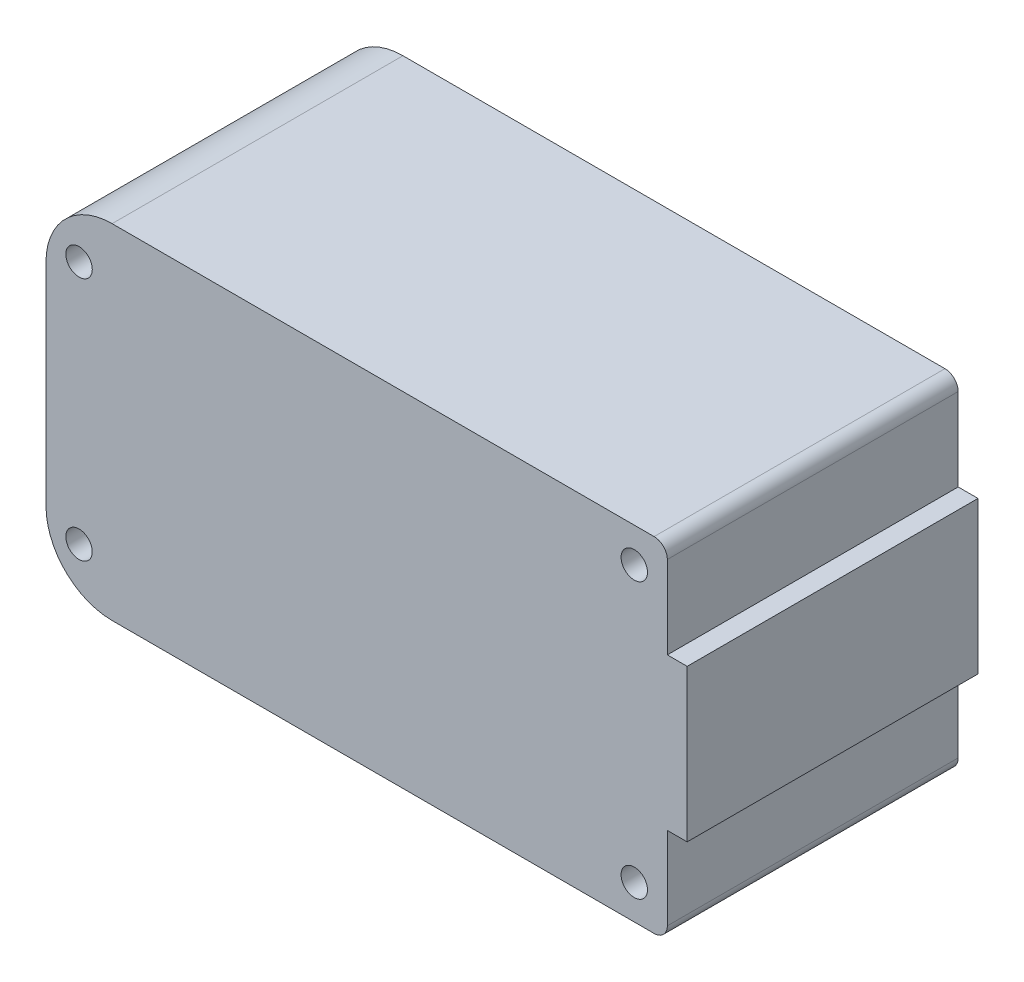
ISO-10303-21;
HEADER;
FILE_DESCRIPTION(('STEP AP214'),'2;1');
FILE_NAME('part.step','',(''),(''),'','','');
FILE_SCHEMA(('AUTOMOTIVE_DESIGN { 1 0 10303 214 1 1 1 1 }'));
ENDSEC;
DATA;
#1=APPLICATION_CONTEXT('core data for automotive mechanical design processes');
#2=APPLICATION_PROTOCOL_DEFINITION('international standard','automotive_design',2000,#1);
#3=PRODUCT_CONTEXT('',#1,'mechanical');
#4=PRODUCT('Part','Part','',(#3));
#5=PRODUCT_RELATED_PRODUCT_CATEGORY('part','',(#4));
#6=PRODUCT_DEFINITION_FORMATION('','',#4);
#7=PRODUCT_DEFINITION_CONTEXT('part definition',#1,'design');
#8=PRODUCT_DEFINITION('design','',#6,#7);
#9=PRODUCT_DEFINITION_SHAPE('','',#8);
#10=(LENGTH_UNIT() NAMED_UNIT(*) SI_UNIT(.MILLI.,.METRE.));
#11=(NAMED_UNIT(*) PLANE_ANGLE_UNIT() SI_UNIT($,.RADIAN.));
#12=(NAMED_UNIT(*) SI_UNIT($,.STERADIAN.) SOLID_ANGLE_UNIT());
#13=UNCERTAINTY_MEASURE_WITH_UNIT(LENGTH_MEASURE(1.E-05),#10,'distance_accuracy_value','');
#14=(GEOMETRIC_REPRESENTATION_CONTEXT(3) GLOBAL_UNCERTAINTY_ASSIGNED_CONTEXT((#13)) GLOBAL_UNIT_ASSIGNED_CONTEXT((#10,
#11,#12)) REPRESENTATION_CONTEXT('',''));
#15=CARTESIAN_POINT('',(0.,0.,0.));
#16=DIRECTION('',(0.,0.,1.));
#17=DIRECTION('',(1.,0.,0.));
#18=AXIS2_PLACEMENT_3D('',#15,#16,#17);
#19=CARTESIAN_POINT('',(0.,0.,11.));
#20=DIRECTION('',(0.,0.,1.));
#21=DIRECTION('',(1.,0.,0.));
#22=AXIS2_PLACEMENT_3D('',#19,#20,#21);
#23=PLANE('',#22);
#24=CARTESIAN_POINT('',(33.,-10.4,11.));
#25=DIRECTION('',(0.,0.,1.));
#26=DIRECTION('',(-1.,0.,0.));
#27=AXIS2_PLACEMENT_3D('',#24,#25,#26);
#28=CIRCLE('',#27,0.999999999999998);
#29=CARTESIAN_POINT('',(32.,-10.4,11.));
#30=VERTEX_POINT('',#29);
#31=EDGE_CURVE('E262',#30,#30,#28,.T.);
#32=ORIENTED_EDGE('',*,*,#31,.F.);
#33=EDGE_LOOP('',(#32));
#34=FACE_BOUND('',#33,.T.);
#35=CARTESIAN_POINT('',(-9.,9.25,11.));
#36=DIRECTION('',(0.,0.,1.));
#37=DIRECTION('',(1.,0.,0.));
#38=AXIS2_PLACEMENT_3D('',#35,#36,#37);
#39=CIRCLE('',#38,1.);
#40=CARTESIAN_POINT('',(-7.99999999999999,9.25,11.));
#41=VERTEX_POINT('',#40);
#42=EDGE_CURVE('E161',#41,#41,#39,.T.);
#43=ORIENTED_EDGE('',*,*,#42,.F.);
#44=EDGE_LOOP('',(#43));
#45=FACE_BOUND('',#44,.T.);
#46=DIRECTION('',(0.,1.,0.));
#47=VECTOR('',#46,1.);
#48=CARTESIAN_POINT('',(35.5,5.75,11.));
#49=LINE('',#48,#47);
#50=CARTESIAN_POINT('',(35.5,5.75,11.));
#51=VERTEX_POINT('',#50);
#52=CARTESIAN_POINT('',(35.5,12.,11.));
#53=VERTEX_POINT('',#52);
#54=EDGE_CURVE('E152',#51,#53,#49,.T.);
#55=ORIENTED_EDGE('',*,*,#54,.T.);
#56=CARTESIAN_POINT('',(34.5,12.,11.));
#57=DIRECTION('',(0.,0.,1.));
#58=DIRECTION('',(1.,0.,0.));
#59=AXIS2_PLACEMENT_3D('',#56,#57,#58);
#60=CIRCLE('',#59,1.);
#61=CARTESIAN_POINT('',(34.5,13.,11.));
#62=VERTEX_POINT('',#61);
#63=EDGE_CURVE('E211',#53,#62,#60,.T.);
#64=ORIENTED_EDGE('',*,*,#63,.T.);
#65=DIRECTION('',(-1.,0.,0.));
#66=VECTOR('',#65,1.);
#67=CARTESIAN_POINT('',(35.5,13.,11.));
#68=LINE('',#67,#66);
#69=CARTESIAN_POINT('',(-6.5,13.,11.));
#70=VERTEX_POINT('',#69);
#71=EDGE_CURVE('E154',#62,#70,#68,.T.);
#72=ORIENTED_EDGE('',*,*,#71,.T.);
#73=CARTESIAN_POINT('',(-6.5,7.99999999999999,11.));
#74=DIRECTION('',(0.,0.,1.));
#75=DIRECTION('',(1.,0.,0.));
#76=AXIS2_PLACEMENT_3D('',#73,#74,#75);
#77=CIRCLE('',#76,5.);
#78=CARTESIAN_POINT('',(-11.5,7.99999999999999,11.));
#79=VERTEX_POINT('',#78);
#80=EDGE_CURVE('E196',#70,#79,#77,.T.);
#81=ORIENTED_EDGE('',*,*,#80,.T.);
#82=DIRECTION('',(0.,-1.,0.));
#83=VECTOR('',#82,1.);
#84=CARTESIAN_POINT('',(-11.5,-13.,11.));
#85=LINE('',#84,#83);
#86=CARTESIAN_POINT('',(-11.5,-8.00000000000001,11.));
#87=VERTEX_POINT('',#86);
#88=EDGE_CURVE('E175',#79,#87,#85,.T.);
#89=ORIENTED_EDGE('',*,*,#88,.T.);
#90=CARTESIAN_POINT('',(-6.5,-8.,11.));
#91=DIRECTION('',(0.,0.,1.));
#92=DIRECTION('',(1.,0.,0.));
#93=AXIS2_PLACEMENT_3D('',#90,#91,#92);
#94=CIRCLE('',#93,5.);
#95=CARTESIAN_POINT('',(-6.5,-13.,11.));
#96=VERTEX_POINT('',#95);
#97=EDGE_CURVE('E194',#87,#96,#94,.T.);
#98=ORIENTED_EDGE('',*,*,#97,.T.);
#99=DIRECTION('',(1.,0.,0.));
#100=VECTOR('',#99,1.);
#101=CARTESIAN_POINT('',(35.5,-13.,11.));
#102=LINE('',#101,#100);
#103=CARTESIAN_POINT('',(34.5,-13.,11.));
#104=VERTEX_POINT('',#103);
#105=EDGE_CURVE('E130',#96,#104,#102,.T.);
#106=ORIENTED_EDGE('',*,*,#105,.T.);
#107=CARTESIAN_POINT('',(34.5,-12.,11.));
#108=DIRECTION('',(0.,0.,1.));
#109=DIRECTION('',(1.,0.,0.));
#110=AXIS2_PLACEMENT_3D('',#107,#108,#109);
#111=CIRCLE('',#110,1.);
#112=CARTESIAN_POINT('',(35.5,-12.,11.));
#113=VERTEX_POINT('',#112);
#114=EDGE_CURVE('E49',#104,#113,#111,.T.);
#115=ORIENTED_EDGE('',*,*,#114,.T.);
#116=DIRECTION('',(0.,1.,0.));
#117=VECTOR('',#116,1.);
#118=CARTESIAN_POINT('',(35.5,-13.,11.));
#119=LINE('',#118,#117);
#120=CARTESIAN_POINT('',(35.5,-5.75,11.));
#121=VERTEX_POINT('',#120);
#122=EDGE_CURVE('E120',#113,#121,#119,.T.);
#123=ORIENTED_EDGE('',*,*,#122,.T.);
#124=DIRECTION('',(1.,0.,0.));
#125=VECTOR('',#124,1.);
#126=CARTESIAN_POINT('',(35.5,-5.75,11.));
#127=LINE('',#126,#125);
#128=CARTESIAN_POINT('',(37.,-5.75,11.));
#129=VERTEX_POINT('',#128);
#130=EDGE_CURVE('E125',#121,#129,#127,.T.);
#131=ORIENTED_EDGE('',*,*,#130,.T.);
#132=DIRECTION('',(0.,1.,0.));
#133=VECTOR('',#132,1.);
#134=CARTESIAN_POINT('',(37.,5.75,11.));
#135=LINE('',#134,#133);
#136=CARTESIAN_POINT('',(37.,5.75,11.));
#137=VERTEX_POINT('',#136);
#138=EDGE_CURVE('E145',#129,#137,#135,.T.);
#139=ORIENTED_EDGE('',*,*,#138,.T.);
#140=DIRECTION('',(-1.,0.,0.));
#141=VECTOR('',#140,1.);
#142=CARTESIAN_POINT('',(35.5,5.75,11.));
#143=LINE('',#142,#141);
#144=EDGE_CURVE('E147',#137,#51,#143,.T.);
#145=ORIENTED_EDGE('',*,*,#144,.T.);
#146=EDGE_LOOP('',(#55,#64,#72,#81,#89,#98,#106,#115,#123,#131,#139,#145));
#147=FACE_BOUND('',#146,.T.);
#148=CARTESIAN_POINT('',(33.,10.4,11.));
#149=DIRECTION('',(0.,0.,1.));
#150=DIRECTION('',(1.,0.,0.));
#151=AXIS2_PLACEMENT_3D('',#148,#149,#150);
#152=CIRCLE('',#151,0.999999999999998);
#153=CARTESIAN_POINT('',(34.,10.4,11.));
#154=VERTEX_POINT('',#153);
#155=EDGE_CURVE('E256',#154,#154,#152,.T.);
#156=ORIENTED_EDGE('',*,*,#155,.F.);
#157=EDGE_LOOP('',(#156));
#158=FACE_BOUND('',#157,.T.);
#159=CARTESIAN_POINT('',(-9.,-9.25,11.));
#160=DIRECTION('',(0.,0.,1.));
#161=DIRECTION('',(-1.,0.,0.));
#162=AXIS2_PLACEMENT_3D('',#159,#160,#161);
#163=CIRCLE('',#162,1.);
#164=CARTESIAN_POINT('',(-10.,-9.25,11.));
#165=VERTEX_POINT('',#164);
#166=EDGE_CURVE('E268',#165,#165,#163,.T.);
#167=ORIENTED_EDGE('',*,*,#166,.F.);
#168=EDGE_LOOP('',(#167));
#169=FACE_BOUND('',#168,.T.);
#170=ADVANCED_FACE('F34',(#34,#45,#147,#158,#169),#23,.T.);
#171=CARTESIAN_POINT('',(0.,0.,-11.));
#172=DIRECTION('',(0.,0.,1.));
#173=DIRECTION('',(1.,0.,0.));
#174=AXIS2_PLACEMENT_3D('',#171,#172,#173);
#175=PLANE('',#174);
#176=CARTESIAN_POINT('',(33.,-10.4,-11.));
#177=DIRECTION('',(0.,0.,1.));
#178=DIRECTION('',(-1.,0.,0.));
#179=AXIS2_PLACEMENT_3D('',#176,#177,#178);
#180=CIRCLE('',#179,0.999999999999998);
#181=CARTESIAN_POINT('',(32.,-10.4,-11.));
#182=VERTEX_POINT('',#181);
#183=EDGE_CURVE('E265',#182,#182,#180,.T.);
#184=ORIENTED_EDGE('',*,*,#183,.T.);
#185=EDGE_LOOP('',(#184));
#186=FACE_BOUND('',#185,.T.);
#187=CARTESIAN_POINT('',(-9.,9.25,-11.));
#188=DIRECTION('',(0.,0.,1.));
#189=DIRECTION('',(1.,0.,0.));
#190=AXIS2_PLACEMENT_3D('',#187,#188,#189);
#191=CIRCLE('',#190,1.);
#192=CARTESIAN_POINT('',(-7.99999999999999,9.25,-11.));
#193=VERTEX_POINT('',#192);
#194=EDGE_CURVE('E253',#193,#193,#191,.T.);
#195=ORIENTED_EDGE('',*,*,#194,.T.);
#196=EDGE_LOOP('',(#195));
#197=FACE_BOUND('',#196,.T.);
#198=DIRECTION('',(-1.,0.,0.));
#199=VECTOR('',#198,1.);
#200=CARTESIAN_POINT('',(35.5,13.,-11.));
#201=LINE('',#200,#199);
#202=CARTESIAN_POINT('',(34.5,13.,-11.));
#203=VERTEX_POINT('',#202);
#204=CARTESIAN_POINT('',(-6.5,13.,-11.));
#205=VERTEX_POINT('',#204);
#206=EDGE_CURVE('E173',#203,#205,#201,.T.);
#207=ORIENTED_EDGE('',*,*,#206,.F.);
#208=CARTESIAN_POINT('',(34.5,12.,-11.));
#209=DIRECTION('',(0.,0.,1.));
#210=DIRECTION('',(1.,0.,0.));
#211=AXIS2_PLACEMENT_3D('',#208,#209,#210);
#212=CIRCLE('',#211,1.);
#213=CARTESIAN_POINT('',(35.5,12.,-11.));
#214=VERTEX_POINT('',#213);
#215=EDGE_CURVE('E206',#203,#214,#212,.F.);
#216=ORIENTED_EDGE('',*,*,#215,.T.);
#217=DIRECTION('',(0.,1.,0.));
#218=VECTOR('',#217,1.);
#219=CARTESIAN_POINT('',(35.5,5.75,-11.));
#220=LINE('',#219,#218);
#221=CARTESIAN_POINT('',(35.5,5.75,-11.));
#222=VERTEX_POINT('',#221);
#223=EDGE_CURVE('E170',#222,#214,#220,.T.);
#224=ORIENTED_EDGE('',*,*,#223,.F.);
#225=DIRECTION('',(-1.,0.,0.));
#226=VECTOR('',#225,1.);
#227=CARTESIAN_POINT('',(35.5,5.75,-11.));
#228=LINE('',#227,#226);
#229=CARTESIAN_POINT('',(37.,5.75,-11.));
#230=VERTEX_POINT('',#229);
#231=EDGE_CURVE('E168',#230,#222,#228,.T.);
#232=ORIENTED_EDGE('',*,*,#231,.F.);
#233=DIRECTION('',(0.,1.,0.));
#234=VECTOR('',#233,1.);
#235=CARTESIAN_POINT('',(37.,5.75,-11.));
#236=LINE('',#235,#234);
#237=CARTESIAN_POINT('',(37.,-5.75,-11.));
#238=VERTEX_POINT('',#237);
#239=EDGE_CURVE('E166',#238,#230,#236,.T.);
#240=ORIENTED_EDGE('',*,*,#239,.F.);
#241=DIRECTION('',(1.,0.,0.));
#242=VECTOR('',#241,1.);
#243=CARTESIAN_POINT('',(35.5,-5.75,-11.));
#244=LINE('',#243,#242);
#245=CARTESIAN_POINT('',(35.5,-5.75,-11.));
#246=VERTEX_POINT('',#245);
#247=EDGE_CURVE('E164',#246,#238,#244,.T.);
#248=ORIENTED_EDGE('',*,*,#247,.F.);
#249=DIRECTION('',(0.,1.,0.));
#250=VECTOR('',#249,1.);
#251=CARTESIAN_POINT('',(35.5,-13.,-11.));
#252=LINE('',#251,#250);
#253=CARTESIAN_POINT('',(35.5,-12.,-11.));
#254=VERTEX_POINT('',#253);
#255=EDGE_CURVE('E136',#254,#246,#252,.T.);
#256=ORIENTED_EDGE('',*,*,#255,.F.);
#257=CARTESIAN_POINT('',(34.5,-12.,-11.));
#258=DIRECTION('',(0.,0.,1.));
#259=DIRECTION('',(1.,0.,0.));
#260=AXIS2_PLACEMENT_3D('',#257,#258,#259);
#261=CIRCLE('',#260,1.);
#262=CARTESIAN_POINT('',(34.5,-13.,-11.));
#263=VERTEX_POINT('',#262);
#264=EDGE_CURVE('E204',#254,#263,#261,.F.);
#265=ORIENTED_EDGE('',*,*,#264,.T.);
#266=DIRECTION('',(1.,0.,0.));
#267=VECTOR('',#266,1.);
#268=CARTESIAN_POINT('',(35.5,-13.,-11.));
#269=LINE('',#268,#267);
#270=CARTESIAN_POINT('',(-6.5,-13.,-11.));
#271=VERTEX_POINT('',#270);
#272=EDGE_CURVE('E160',#271,#263,#269,.T.);
#273=ORIENTED_EDGE('',*,*,#272,.F.);
#274=CARTESIAN_POINT('',(-6.5,-8.,-11.));
#275=DIRECTION('',(0.,0.,1.));
#276=DIRECTION('',(1.,0.,0.));
#277=AXIS2_PLACEMENT_3D('',#274,#275,#276);
#278=CIRCLE('',#277,5.);
#279=CARTESIAN_POINT('',(-11.5,-8.00000000000001,-11.));
#280=VERTEX_POINT('',#279);
#281=EDGE_CURVE('E186',#271,#280,#278,.F.);
#282=ORIENTED_EDGE('',*,*,#281,.T.);
#283=DIRECTION('',(0.,-1.,0.));
#284=VECTOR('',#283,1.);
#285=CARTESIAN_POINT('',(-11.5,-13.,-11.));
#286=LINE('',#285,#284);
#287=CARTESIAN_POINT('',(-11.5,7.99999999999999,-11.));
#288=VERTEX_POINT('',#287);
#289=EDGE_CURVE('E157',#288,#280,#286,.T.);
#290=ORIENTED_EDGE('',*,*,#289,.F.);
#291=CARTESIAN_POINT('',(-6.5,7.99999999999999,-11.));
#292=DIRECTION('',(0.,0.,1.));
#293=DIRECTION('',(1.,0.,0.));
#294=AXIS2_PLACEMENT_3D('',#291,#292,#293);
#295=CIRCLE('',#294,5.);
#296=EDGE_CURVE('E188',#288,#205,#295,.F.);
#297=ORIENTED_EDGE('',*,*,#296,.T.);
#298=EDGE_LOOP('',(#207,#216,#224,#232,#240,#248,#256,#265,#273,#282,#290,#297));
#299=FACE_BOUND('',#298,.T.);
#300=CARTESIAN_POINT('',(33.,10.4,-11.));
#301=DIRECTION('',(0.,0.,1.));
#302=DIRECTION('',(1.,0.,0.));
#303=AXIS2_PLACEMENT_3D('',#300,#301,#302);
#304=CIRCLE('',#303,0.999999999999998);
#305=CARTESIAN_POINT('',(34.,10.4,-11.));
#306=VERTEX_POINT('',#305);
#307=EDGE_CURVE('E259',#306,#306,#304,.T.);
#308=ORIENTED_EDGE('',*,*,#307,.T.);
#309=EDGE_LOOP('',(#308));
#310=FACE_BOUND('',#309,.T.);
#311=CARTESIAN_POINT('',(-9.,-9.25,-11.));
#312=DIRECTION('',(0.,0.,1.));
#313=DIRECTION('',(-1.,0.,0.));
#314=AXIS2_PLACEMENT_3D('',#311,#312,#313);
#315=CIRCLE('',#314,1.);
#316=CARTESIAN_POINT('',(-10.,-9.25,-11.));
#317=VERTEX_POINT('',#316);
#318=EDGE_CURVE('E271',#317,#317,#315,.T.);
#319=ORIENTED_EDGE('',*,*,#318,.T.);
#320=EDGE_LOOP('',(#319));
#321=FACE_BOUND('',#320,.T.);
#322=ADVANCED_FACE('F215',(#186,#197,#299,#310,#321),#175,.F.);
#323=CARTESIAN_POINT('',(-11.5,-13.,11.));
#324=DIRECTION('',(1.,0.,0.));
#325=DIRECTION('',(0.,1.,0.));
#326=AXIS2_PLACEMENT_3D('',#323,#324,#325);
#327=PLANE('',#326);
#328=ORIENTED_EDGE('',*,*,#88,.F.);
#329=DIRECTION('',(0.,0.,-1.));
#330=VECTOR('',#329,1.);
#331=CARTESIAN_POINT('',(-11.5,7.99999999999999,11.));
#332=LINE('',#331,#330);
#333=EDGE_CURVE('E183',#79,#288,#332,.T.);
#334=ORIENTED_EDGE('',*,*,#333,.T.);
#335=ORIENTED_EDGE('',*,*,#289,.T.);
#336=DIRECTION('',(0.,0.,-1.));
#337=VECTOR('',#336,1.);
#338=CARTESIAN_POINT('',(-11.5,-8.,11.));
#339=LINE('',#338,#337);
#340=EDGE_CURVE('E139',#280,#87,#339,.F.);
#341=ORIENTED_EDGE('',*,*,#340,.T.);
#342=EDGE_LOOP('',(#328,#334,#335,#341));
#343=FACE_BOUND('',#342,.T.);
#344=ADVANCED_FACE('F248',(#343),#327,.F.);
#345=CARTESIAN_POINT('',(35.5,-13.,11.));
#346=DIRECTION('',(0.,1.,0.));
#347=DIRECTION('',(-1.,0.,0.));
#348=AXIS2_PLACEMENT_3D('',#345,#346,#347);
#349=PLANE('',#348);
#350=ORIENTED_EDGE('',*,*,#272,.T.);
#351=DIRECTION('',(0.,0.,-1.));
#352=VECTOR('',#351,1.);
#353=CARTESIAN_POINT('',(34.5,-13.,11.));
#354=LINE('',#353,#352);
#355=EDGE_CURVE('E11',#263,#104,#354,.F.);
#356=ORIENTED_EDGE('',*,*,#355,.T.);
#357=ORIENTED_EDGE('',*,*,#105,.F.);
#358=DIRECTION('',(0.,0.,-1.));
#359=VECTOR('',#358,1.);
#360=CARTESIAN_POINT('',(-6.5,-13.,11.));
#361=LINE('',#360,#359);
#362=EDGE_CURVE('E198',#96,#271,#361,.T.);
#363=ORIENTED_EDGE('',*,*,#362,.T.);
#364=EDGE_LOOP('',(#350,#356,#357,#363));
#365=FACE_BOUND('',#364,.T.);
#366=ADVANCED_FACE('F306',(#365),#349,.F.);
#367=CARTESIAN_POINT('',(35.5,-13.,11.));
#368=DIRECTION('',(-1.,0.,0.));
#369=DIRECTION('',(0.,0.,1.));
#370=AXIS2_PLACEMENT_3D('',#367,#368,#369);
#371=PLANE('',#370);
#372=ORIENTED_EDGE('',*,*,#122,.F.);
#373=DIRECTION('',(0.,0.,-1.));
#374=VECTOR('',#373,1.);
#375=CARTESIAN_POINT('',(35.5,-12.,11.));
#376=LINE('',#375,#374);
#377=EDGE_CURVE('E42',#113,#254,#376,.T.);
#378=ORIENTED_EDGE('',*,*,#377,.T.);
#379=ORIENTED_EDGE('',*,*,#255,.T.);
#380=DIRECTION('',(0.,0.,-1.));
#381=VECTOR('',#380,1.);
#382=CARTESIAN_POINT('',(35.5,-5.75,11.));
#383=LINE('',#382,#381);
#384=EDGE_CURVE('E133',#121,#246,#383,.T.);
#385=ORIENTED_EDGE('',*,*,#384,.F.);
#386=EDGE_LOOP('',(#372,#378,#379,#385));
#387=FACE_BOUND('',#386,.T.);
#388=ADVANCED_FACE('F134',(#387),#371,.F.);
#389=CARTESIAN_POINT('',(35.5,-5.75,11.));
#390=DIRECTION('',(0.,1.,0.));
#391=DIRECTION('',(0.,0.,1.));
#392=AXIS2_PLACEMENT_3D('',#389,#390,#391);
#393=PLANE('',#392);
#394=ORIENTED_EDGE('',*,*,#247,.T.);
#395=DIRECTION('',(0.,0.,-1.));
#396=VECTOR('',#395,1.);
#397=CARTESIAN_POINT('',(37.,-5.75,11.));
#398=LINE('',#397,#396);
#399=EDGE_CURVE('E140',#129,#238,#398,.T.);
#400=ORIENTED_EDGE('',*,*,#399,.F.);
#401=ORIENTED_EDGE('',*,*,#130,.F.);
#402=ORIENTED_EDGE('',*,*,#384,.T.);
#403=EDGE_LOOP('',(#394,#400,#401,#402));
#404=FACE_BOUND('',#403,.T.);
#405=ADVANCED_FACE('F142',(#404),#393,.F.);
#406=CARTESIAN_POINT('',(37.,5.75,11.));
#407=DIRECTION('',(-1.,0.,0.));
#408=DIRECTION('',(0.,0.,1.));
#409=AXIS2_PLACEMENT_3D('',#406,#407,#408);
#410=PLANE('',#409);
#411=ORIENTED_EDGE('',*,*,#239,.T.);
#412=DIRECTION('',(0.,0.,-1.));
#413=VECTOR('',#412,1.);
#414=CARTESIAN_POINT('',(37.,5.75,11.));
#415=LINE('',#414,#413);
#416=EDGE_CURVE('E178',#137,#230,#415,.T.);
#417=ORIENTED_EDGE('',*,*,#416,.F.);
#418=ORIENTED_EDGE('',*,*,#138,.F.);
#419=ORIENTED_EDGE('',*,*,#399,.T.);
#420=EDGE_LOOP('',(#411,#417,#418,#419));
#421=FACE_BOUND('',#420,.T.);
#422=ADVANCED_FACE('F221',(#421),#410,.F.);
#423=CARTESIAN_POINT('',(35.5,5.75,11.));
#424=DIRECTION('',(0.,-1.,0.));
#425=DIRECTION('',(0.,0.,-1.));
#426=AXIS2_PLACEMENT_3D('',#423,#424,#425);
#427=PLANE('',#426);
#428=ORIENTED_EDGE('',*,*,#231,.T.);
#429=DIRECTION('',(0.,0.,-1.));
#430=VECTOR('',#429,1.);
#431=CARTESIAN_POINT('',(35.5,5.75,11.));
#432=LINE('',#431,#430);
#433=EDGE_CURVE('E156',#51,#222,#432,.T.);
#434=ORIENTED_EDGE('',*,*,#433,.F.);
#435=ORIENTED_EDGE('',*,*,#144,.F.);
#436=ORIENTED_EDGE('',*,*,#416,.T.);
#437=EDGE_LOOP('',(#428,#434,#435,#436));
#438=FACE_BOUND('',#437,.T.);
#439=ADVANCED_FACE('F228',(#438),#427,.F.);
#440=CARTESIAN_POINT('',(35.5,5.75,11.));
#441=DIRECTION('',(-1.,0.,0.));
#442=DIRECTION('',(0.,0.,1.));
#443=AXIS2_PLACEMENT_3D('',#440,#441,#442);
#444=PLANE('',#443);
#445=ORIENTED_EDGE('',*,*,#223,.T.);
#446=DIRECTION('',(0.,0.,-1.));
#447=VECTOR('',#446,1.);
#448=CARTESIAN_POINT('',(35.5,12.,11.));
#449=LINE('',#448,#447);
#450=EDGE_CURVE('E208',#214,#53,#449,.F.);
#451=ORIENTED_EDGE('',*,*,#450,.T.);
#452=ORIENTED_EDGE('',*,*,#54,.F.);
#453=ORIENTED_EDGE('',*,*,#433,.T.);
#454=EDGE_LOOP('',(#445,#451,#452,#453));
#455=FACE_BOUND('',#454,.T.);
#456=ADVANCED_FACE('F231',(#455),#444,.F.);
#457=CARTESIAN_POINT('',(35.5,13.,11.));
#458=DIRECTION('',(0.,-1.,0.));
#459=DIRECTION('',(1.,0.,0.));
#460=AXIS2_PLACEMENT_3D('',#457,#458,#459);
#461=PLANE('',#460);
#462=ORIENTED_EDGE('',*,*,#71,.F.);
#463=DIRECTION('',(0.,0.,-1.));
#464=VECTOR('',#463,1.);
#465=CARTESIAN_POINT('',(34.5,13.,11.));
#466=LINE('',#465,#464);
#467=EDGE_CURVE('E201',#62,#203,#466,.T.);
#468=ORIENTED_EDGE('',*,*,#467,.T.);
#469=ORIENTED_EDGE('',*,*,#206,.T.);
#470=DIRECTION('',(0.,0.,-1.));
#471=VECTOR('',#470,1.);
#472=CARTESIAN_POINT('',(-6.5,13.,11.));
#473=LINE('',#472,#471);
#474=EDGE_CURVE('E191',#205,#70,#473,.F.);
#475=ORIENTED_EDGE('',*,*,#474,.T.);
#476=EDGE_LOOP('',(#462,#468,#469,#475));
#477=FACE_BOUND('',#476,.T.);
#478=ADVANCED_FACE('F238',(#477),#461,.F.);
#479=CARTESIAN_POINT('',(-9.,9.25,11.));
#480=DIRECTION('',(0.,0.,-1.));
#481=DIRECTION('',(-1.,0.,0.));
#482=AXIS2_PLACEMENT_3D('',#479,#480,#481);
#483=CYLINDRICAL_SURFACE('',#482,1.);
#484=ORIENTED_EDGE('',*,*,#42,.T.);
#485=EDGE_LOOP('',(#484));
#486=FACE_BOUND('',#485,.T.);
#487=ORIENTED_EDGE('',*,*,#194,.F.);
#488=EDGE_LOOP('',(#487));
#489=FACE_BOUND('',#488,.T.);
#490=ADVANCED_FACE('F291',(#486,#489),#483,.F.);
#491=CARTESIAN_POINT('',(33.,10.4,11.));
#492=DIRECTION('',(0.,0.,-1.));
#493=DIRECTION('',(-1.,0.,0.));
#494=AXIS2_PLACEMENT_3D('',#491,#492,#493);
#495=CYLINDRICAL_SURFACE('',#494,0.999999999999998);
#496=ORIENTED_EDGE('',*,*,#155,.T.);
#497=EDGE_LOOP('',(#496));
#498=FACE_BOUND('',#497,.T.);
#499=ORIENTED_EDGE('',*,*,#307,.F.);
#500=EDGE_LOOP('',(#499));
#501=FACE_BOUND('',#500,.T.);
#502=ADVANCED_FACE('F400',(#498,#501),#495,.F.);
#503=CARTESIAN_POINT('',(33.,-10.4,11.));
#504=DIRECTION('',(0.,0.,-1.));
#505=DIRECTION('',(-1.,0.,0.));
#506=AXIS2_PLACEMENT_3D('',#503,#504,#505);
#507=CYLINDRICAL_SURFACE('',#506,0.999999999999998);
#508=ORIENTED_EDGE('',*,*,#31,.T.);
#509=EDGE_LOOP('',(#508));
#510=FACE_BOUND('',#509,.T.);
#511=ORIENTED_EDGE('',*,*,#183,.F.);
#512=EDGE_LOOP('',(#511));
#513=FACE_BOUND('',#512,.T.);
#514=ADVANCED_FACE('F391',(#510,#513),#507,.F.);
#515=CARTESIAN_POINT('',(-9.,-9.25,11.));
#516=DIRECTION('',(0.,0.,-1.));
#517=DIRECTION('',(-1.,0.,0.));
#518=AXIS2_PLACEMENT_3D('',#515,#516,#517);
#519=CYLINDRICAL_SURFACE('',#518,1.);
#520=ORIENTED_EDGE('',*,*,#166,.T.);
#521=EDGE_LOOP('',(#520));
#522=FACE_BOUND('',#521,.T.);
#523=ORIENTED_EDGE('',*,*,#318,.F.);
#524=EDGE_LOOP('',(#523));
#525=FACE_BOUND('',#524,.T.);
#526=ADVANCED_FACE('F277',(#522,#525),#519,.F.);
#527=CARTESIAN_POINT('',(-6.5,7.99999999999999,11.));
#528=DIRECTION('',(0.,0.,-1.));
#529=DIRECTION('',(-1.,0.,0.));
#530=AXIS2_PLACEMENT_3D('',#527,#528,#529);
#531=CYLINDRICAL_SURFACE('',#530,5.);
#532=ORIENTED_EDGE('',*,*,#80,.F.);
#533=ORIENTED_EDGE('',*,*,#474,.F.);
#534=ORIENTED_EDGE('',*,*,#296,.F.);
#535=ORIENTED_EDGE('',*,*,#333,.F.);
#536=EDGE_LOOP('',(#532,#533,#534,#535));
#537=FACE_BOUND('',#536,.T.);
#538=ADVANCED_FACE('F243',(#537),#531,.T.);
#539=CARTESIAN_POINT('',(-6.5,-8.,11.));
#540=DIRECTION('',(0.,0.,-1.));
#541=DIRECTION('',(-1.,0.,0.));
#542=AXIS2_PLACEMENT_3D('',#539,#540,#541);
#543=CYLINDRICAL_SURFACE('',#542,5.);
#544=ORIENTED_EDGE('',*,*,#97,.F.);
#545=ORIENTED_EDGE('',*,*,#340,.F.);
#546=ORIENTED_EDGE('',*,*,#281,.F.);
#547=ORIENTED_EDGE('',*,*,#362,.F.);
#548=EDGE_LOOP('',(#544,#545,#546,#547));
#549=FACE_BOUND('',#548,.T.);
#550=ADVANCED_FACE('F313',(#549),#543,.T.);
#551=CARTESIAN_POINT('',(34.5,12.,11.));
#552=DIRECTION('',(0.,0.,-1.));
#553=DIRECTION('',(-1.,0.,0.));
#554=AXIS2_PLACEMENT_3D('',#551,#552,#553);
#555=CYLINDRICAL_SURFACE('',#554,1.);
#556=ORIENTED_EDGE('',*,*,#63,.F.);
#557=ORIENTED_EDGE('',*,*,#450,.F.);
#558=ORIENTED_EDGE('',*,*,#215,.F.);
#559=ORIENTED_EDGE('',*,*,#467,.F.);
#560=EDGE_LOOP('',(#556,#557,#558,#559));
#561=FACE_BOUND('',#560,.T.);
#562=ADVANCED_FACE('F234',(#561),#555,.T.);
#563=CARTESIAN_POINT('',(34.5,-12.,11.));
#564=DIRECTION('',(0.,0.,-1.));
#565=DIRECTION('',(-1.,0.,0.));
#566=AXIS2_PLACEMENT_3D('',#563,#564,#565);
#567=CYLINDRICAL_SURFACE('',#566,1.);
#568=ORIENTED_EDGE('',*,*,#114,.F.);
#569=ORIENTED_EDGE('',*,*,#355,.F.);
#570=ORIENTED_EDGE('',*,*,#264,.F.);
#571=ORIENTED_EDGE('',*,*,#377,.F.);
#572=EDGE_LOOP('',(#568,#569,#570,#571));
#573=FACE_BOUND('',#572,.T.);
#574=ADVANCED_FACE('F36',(#573),#567,.T.);
#575=CLOSED_SHELL('',(#170,#322,#344,#366,#388,#405,#422,#439,#456,#478,#490,#502,#514,#526,
#538,#550,#562,#574));
#576=MANIFOLD_SOLID_BREP('B2',#575);
#577=ADVANCED_BREP_SHAPE_REPRESENTATION('',(#18,#576),#14);
#578=SHAPE_DEFINITION_REPRESENTATION(#9,#577);
ENDSEC;
END-ISO-10303-21;
